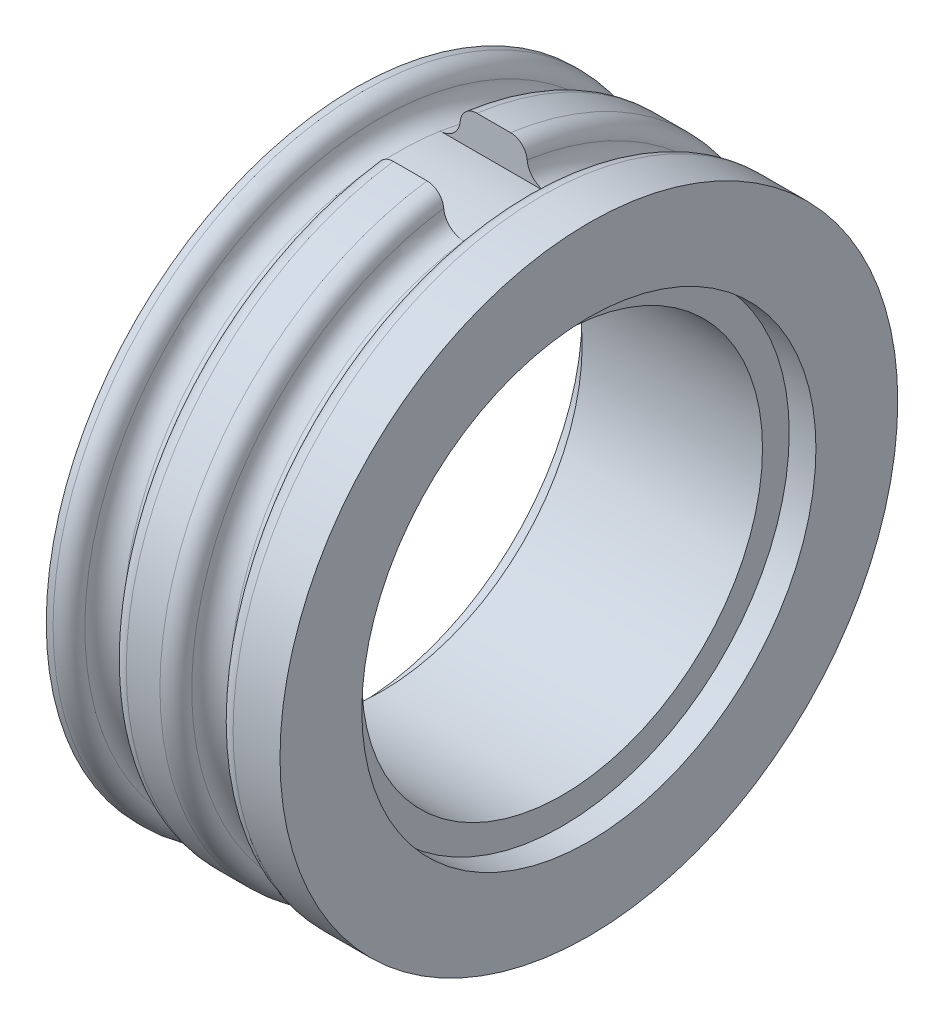
ISO-10303-21;
HEADER;
FILE_DESCRIPTION(('STEP AP214'),'2;1');
FILE_NAME('part.step','',(''),(''),'','','');
FILE_SCHEMA(('AUTOMOTIVE_DESIGN { 1 0 10303 214 1 1 1 1 }'));
ENDSEC;
DATA;
#1=APPLICATION_CONTEXT('core data for automotive mechanical design processes');
#2=APPLICATION_PROTOCOL_DEFINITION('international standard','automotive_design',2000,#1);
#3=PRODUCT_CONTEXT('',#1,'mechanical');
#4=PRODUCT('Part','Part','',(#3));
#5=PRODUCT_RELATED_PRODUCT_CATEGORY('part','',(#4));
#6=PRODUCT_DEFINITION_FORMATION('','',#4);
#7=PRODUCT_DEFINITION_CONTEXT('part definition',#1,'design');
#8=PRODUCT_DEFINITION('design','',#6,#7);
#9=PRODUCT_DEFINITION_SHAPE('','',#8);
#10=(LENGTH_UNIT() NAMED_UNIT(*) SI_UNIT(.MILLI.,.METRE.));
#11=(NAMED_UNIT(*) PLANE_ANGLE_UNIT() SI_UNIT($,.RADIAN.));
#12=(NAMED_UNIT(*) SI_UNIT($,.STERADIAN.) SOLID_ANGLE_UNIT());
#13=UNCERTAINTY_MEASURE_WITH_UNIT(LENGTH_MEASURE(1.E-05),#10,'distance_accuracy_value','');
#14=(GEOMETRIC_REPRESENTATION_CONTEXT(3) GLOBAL_UNCERTAINTY_ASSIGNED_CONTEXT((#13)) GLOBAL_UNIT_ASSIGNED_CONTEXT((#10,
#11,#12)) REPRESENTATION_CONTEXT('',''));
#15=CARTESIAN_POINT('',(0.,0.,0.));
#16=DIRECTION('',(0.,0.,1.));
#17=DIRECTION('',(1.,0.,0.));
#18=AXIS2_PLACEMENT_3D('',#15,#16,#17);
#19=CARTESIAN_POINT('',(7.,0.,0.));
#20=DIRECTION('',(1.,0.,0.));
#21=DIRECTION('',(0.,0.,-1.));
#22=AXIS2_PLACEMENT_3D('',#19,#20,#21);
#23=CYLINDRICAL_SURFACE('',#22,6.);
#24=CARTESIAN_POINT('',(6.2,0.,0.));
#25=DIRECTION('',(1.,0.,0.));
#26=DIRECTION('',(0.,0.,-1.));
#27=AXIS2_PLACEMENT_3D('',#24,#25,#26);
#28=CIRCLE('',#27,6.);
#29=CARTESIAN_POINT('',(6.2,0.,-6.));
#30=VERTEX_POINT('',#29);
#31=EDGE_CURVE('E138',#30,#30,#28,.T.);
#32=ORIENTED_EDGE('',*,*,#31,.T.);
#33=EDGE_LOOP('',(#32));
#34=FACE_BOUND('',#33,.T.);
#35=CARTESIAN_POINT('',(0.8,0.,0.));
#36=DIRECTION('',(-1.,0.,0.));
#37=DIRECTION('',(0.,0.,1.));
#38=AXIS2_PLACEMENT_3D('',#35,#36,#37);
#39=CIRCLE('',#38,6.);
#40=CARTESIAN_POINT('',(0.8,0.,6.));
#41=VERTEX_POINT('',#40);
#42=EDGE_CURVE('E148',#41,#41,#39,.T.);
#43=ORIENTED_EDGE('',*,*,#42,.T.);
#44=EDGE_LOOP('',(#43));
#45=FACE_BOUND('',#44,.T.);
#46=ADVANCED_FACE('F47',(#34,#45),#23,.F.);
#47=CARTESIAN_POINT('',(7.,0.,0.));
#48=DIRECTION('',(-1.,0.,0.));
#49=DIRECTION('',(0.,0.,1.));
#50=AXIS2_PLACEMENT_3D('',#47,#48,#49);
#51=PLANE('',#50);
#52=CARTESIAN_POINT('',(7.,0.,0.));
#53=DIRECTION('',(1.,0.,0.));
#54=DIRECTION('',(0.,0.,-1.));
#55=AXIS2_PLACEMENT_3D('',#52,#53,#54);
#56=CIRCLE('',#55,6.8);
#57=CARTESIAN_POINT('',(7.,0.,-6.8));
#58=VERTEX_POINT('',#57);
#59=EDGE_CURVE('E152',#58,#58,#56,.T.);
#60=ORIENTED_EDGE('',*,*,#59,.F.);
#61=EDGE_LOOP('',(#60));
#62=FACE_BOUND('',#61,.T.);
#63=CARTESIAN_POINT('',(7.,0.,0.));
#64=DIRECTION('',(1.,0.,0.));
#65=DIRECTION('',(0.,0.,-1.));
#66=AXIS2_PLACEMENT_3D('',#63,#64,#65);
#67=CIRCLE('',#66,9.25);
#68=CARTESIAN_POINT('',(7.,0.,-9.25));
#69=VERTEX_POINT('',#68);
#70=EDGE_CURVE('E133',#69,#69,#67,.T.);
#71=ORIENTED_EDGE('',*,*,#70,.T.);
#72=EDGE_LOOP('',(#71));
#73=FACE_BOUND('',#72,.T.);
#74=ADVANCED_FACE('F263',(#62,#73),#51,.F.);
#75=CARTESIAN_POINT('',(7.,0.,0.));
#76=DIRECTION('',(1.,0.,0.));
#77=DIRECTION('',(0.,0.,-1.));
#78=AXIS2_PLACEMENT_3D('',#75,#76,#77);
#79=CYLINDRICAL_SURFACE('',#78,9.25);
#80=CARTESIAN_POINT('',(5.59544511501033,0.,0.));
#81=DIRECTION('',(-1.,0.,0.));
#82=DIRECTION('',(0.,0.,1.));
#83=AXIS2_PLACEMENT_3D('',#80,#81,#82);
#84=CIRCLE('',#83,9.25);
#85=CARTESIAN_POINT('',(5.59544511501033,0.,9.25));
#86=VERTEX_POINT('',#85);
#87=EDGE_CURVE('E154',#86,#86,#84,.F.);
#88=ORIENTED_EDGE('',*,*,#87,.T.);
#89=EDGE_LOOP('',(#88));
#90=FACE_BOUND('',#89,.T.);
#91=ORIENTED_EDGE('',*,*,#70,.F.);
#92=EDGE_LOOP('',(#91));
#93=FACE_BOUND('',#92,.T.);
#94=ADVANCED_FACE('F270',(#90,#93),#79,.T.);
#95=CARTESIAN_POINT('',(7.,0.,0.));
#96=DIRECTION('',(1.,0.,0.));
#97=DIRECTION('',(0.,0.,-1.));
#98=AXIS2_PLACEMENT_3D('',#95,#96,#97);
#99=CYLINDRICAL_SURFACE('',#98,9.25);
#100=DIRECTION('',(1.,0.,0.));
#101=VECTOR('',#100,1.);
#102=CARTESIAN_POINT('',(7.,9.16515138991168,-1.25));
#103=LINE('',#102,#101);
#104=CARTESIAN_POINT('',(2.39544511501033,9.16515138991168,-1.25));
#105=VERTEX_POINT('',#104);
#106=CARTESIAN_POINT('',(3.40455488498967,9.16515138991168,-1.25));
#107=VERTEX_POINT('',#106);
#108=EDGE_CURVE('E126',#105,#107,#103,.T.);
#109=ORIENTED_EDGE('',*,*,#108,.T.);
#110=CARTESIAN_POINT('',(3.40455488498967,0.,0.));
#111=DIRECTION('',(-1.,0.,0.));
#112=DIRECTION('',(0.,0.,1.));
#113=AXIS2_PLACEMENT_3D('',#110,#111,#112);
#114=CIRCLE('',#113,9.25);
#115=CARTESIAN_POINT('',(3.40455488498967,9.16515138991168,1.25));
#116=VERTEX_POINT('',#115);
#117=EDGE_CURVE('E489',#107,#116,#114,.T.);
#118=ORIENTED_EDGE('',*,*,#117,.T.);
#119=DIRECTION('',(1.,0.,0.));
#120=VECTOR('',#119,1.);
#121=CARTESIAN_POINT('',(7.,9.16515138991168,1.25));
#122=LINE('',#121,#120);
#123=CARTESIAN_POINT('',(2.39544511501033,9.16515138991168,1.25));
#124=VERTEX_POINT('',#123);
#125=EDGE_CURVE('E310',#116,#124,#122,.F.);
#126=ORIENTED_EDGE('',*,*,#125,.T.);
#127=CARTESIAN_POINT('',(2.39544511501033,0.,0.));
#128=DIRECTION('',(-1.,0.,0.));
#129=DIRECTION('',(0.,0.,1.));
#130=AXIS2_PLACEMENT_3D('',#127,#128,#129);
#131=CIRCLE('',#130,9.25);
#132=EDGE_CURVE('E491',#124,#105,#131,.F.);
#133=ORIENTED_EDGE('',*,*,#132,.T.);
#134=EDGE_LOOP('',(#109,#118,#126,#133));
#135=FACE_BOUND('',#134,.T.);
#136=ADVANCED_FACE('F284',(#135),#99,.T.);
#137=CARTESIAN_POINT('',(7.,0.,0.));
#138=DIRECTION('',(1.,0.,0.));
#139=DIRECTION('',(0.,0.,-1.));
#140=AXIS2_PLACEMENT_3D('',#137,#138,#139);
#141=CYLINDRICAL_SURFACE('',#140,8.25);
#142=CARTESIAN_POINT('',(4.5,0.,0.));
#143=DIRECTION('',(1.,0.,0.));
#144=DIRECTION('',(0.,0.,-1.));
#145=AXIS2_PLACEMENT_3D('',#142,#143,#144);
#146=CIRCLE('',#145,8.25);
#147=CARTESIAN_POINT('',(4.5,8.15475321515005,1.25));
#148=VERTEX_POINT('',#147);
#149=CARTESIAN_POINT('',(4.5,8.15475321515004,-1.25));
#150=VERTEX_POINT('',#149);
#151=EDGE_CURVE('E124',#148,#150,#146,.F.);
#152=ORIENTED_EDGE('',*,*,#151,.T.);
#153=DIRECTION('',(1.,0.,0.));
#154=VECTOR('',#153,1.);
#155=CARTESIAN_POINT('',(7.,8.15475321515005,-1.25));
#156=LINE('',#155,#154);
#157=CARTESIAN_POINT('',(1.3,8.15475321515004,-1.25));
#158=VERTEX_POINT('',#157);
#159=EDGE_CURVE('E106',#150,#158,#156,.F.);
#160=ORIENTED_EDGE('',*,*,#159,.T.);
#161=CARTESIAN_POINT('',(1.3,0.,0.));
#162=DIRECTION('',(-1.,0.,0.));
#163=DIRECTION('',(0.,0.,1.));
#164=AXIS2_PLACEMENT_3D('',#161,#162,#163);
#165=CIRCLE('',#164,8.25);
#166=CARTESIAN_POINT('',(1.3,8.15475321515004,1.25));
#167=VERTEX_POINT('',#166);
#168=EDGE_CURVE('E121',#158,#167,#165,.F.);
#169=ORIENTED_EDGE('',*,*,#168,.T.);
#170=DIRECTION('',(1.,0.,0.));
#171=VECTOR('',#170,1.);
#172=CARTESIAN_POINT('',(7.,8.15475321515005,1.25));
#173=LINE('',#172,#171);
#174=EDGE_CURVE('E127',#167,#148,#173,.T.);
#175=ORIENTED_EDGE('',*,*,#174,.T.);
#176=EDGE_LOOP('',(#152,#160,#169,#175));
#177=FACE_BOUND('',#176,.T.);
#178=ADVANCED_FACE('F119',(#177),#141,.T.);
#179=CARTESIAN_POINT('',(7.,0.,0.));
#180=DIRECTION('',(1.,0.,0.));
#181=DIRECTION('',(0.,0.,-1.));
#182=AXIS2_PLACEMENT_3D('',#179,#180,#181);
#183=CYLINDRICAL_SURFACE('',#182,9.25);
#184=CARTESIAN_POINT('',(0.204554884989668,0.,0.));
#185=DIRECTION('',(-1.,0.,0.));
#186=DIRECTION('',(0.,0.,1.));
#187=AXIS2_PLACEMENT_3D('',#184,#185,#186);
#188=CIRCLE('',#187,9.25);
#189=CARTESIAN_POINT('',(0.204554884989668,0.,9.25));
#190=VERTEX_POINT('',#189);
#191=EDGE_CURVE('E11',#190,#190,#188,.T.);
#192=ORIENTED_EDGE('',*,*,#191,.T.);
#193=EDGE_LOOP('',(#192));
#194=FACE_BOUND('',#193,.T.);
#195=CARTESIAN_POINT('',(0.,0.,0.));
#196=DIRECTION('',(1.,0.,0.));
#197=DIRECTION('',(0.,0.,-1.));
#198=AXIS2_PLACEMENT_3D('',#195,#196,#197);
#199=CIRCLE('',#198,9.25);
#200=CARTESIAN_POINT('',(0.,0.,-9.25));
#201=VERTEX_POINT('',#200);
#202=EDGE_CURVE('E306',#201,#201,#199,.T.);
#203=ORIENTED_EDGE('',*,*,#202,.T.);
#204=EDGE_LOOP('',(#203));
#205=FACE_BOUND('',#204,.T.);
#206=ADVANCED_FACE('F277',(#194,#205),#183,.T.);
#207=CARTESIAN_POINT('',(0.,0.,0.));
#208=DIRECTION('',(1.,0.,0.));
#209=DIRECTION('',(0.,0.,-1.));
#210=AXIS2_PLACEMENT_3D('',#207,#208,#209);
#211=PLANE('',#210);
#212=CARTESIAN_POINT('',(0.,0.,0.));
#213=DIRECTION('',(-1.,0.,0.));
#214=DIRECTION('',(0.,0.,1.));
#215=AXIS2_PLACEMENT_3D('',#212,#213,#214);
#216=CIRCLE('',#215,6.8);
#217=CARTESIAN_POINT('',(0.,0.,6.8));
#218=VERTEX_POINT('',#217);
#219=EDGE_CURVE('E324',#218,#218,#216,.T.);
#220=ORIENTED_EDGE('',*,*,#219,.F.);
#221=EDGE_LOOP('',(#220));
#222=FACE_BOUND('',#221,.T.);
#223=ORIENTED_EDGE('',*,*,#202,.F.);
#224=EDGE_LOOP('',(#223));
#225=FACE_BOUND('',#224,.T.);
#226=ADVANCED_FACE('F275',(#222,#225),#211,.F.);
#227=CARTESIAN_POINT('',(1.9,-9.251,1.25));
#228=DIRECTION('',(0.,0.,1.));
#229=DIRECTION('',(1.,0.,0.));
#230=AXIS2_PLACEMENT_3D('',#227,#228,#229);
#231=PLANE('',#230);
#232=ORIENTED_EDGE('',*,*,#125,.F.);
#233=CARTESIAN_POINT('',(3.40455488498967,9.16515138991168,1.25));
#234=CARTESIAN_POINT('',(3.43249351819671,9.16517630573256,1.25));
#235=CARTESIAN_POINT('',(3.46042356305605,9.16278954776588,1.25));
#236=CARTESIAN_POINT('',(3.51546379544043,9.15337802234948,1.25));
#237=CARTESIAN_POINT('',(3.54257476786295,9.1463578525907,1.25));
#238=CARTESIAN_POINT('',(3.59524318498539,9.12786045631032,1.25));
#239=CARTESIAN_POINT('',(3.62080000122142,9.11638144041699,1.25));
#240=CARTESIAN_POINT('',(3.66962964992181,9.08931565895298,1.25));
#241=CARTESIAN_POINT('',(3.69290286133862,9.07372957651633,1.25));
#242=CARTESIAN_POINT('',(3.73661188938513,9.03883387161643,1.25));
#243=CARTESIAN_POINT('',(3.75703653731982,9.01951026434254,1.25));
#244=CARTESIAN_POINT('',(3.79439383195117,8.97772648410406,1.25));
#245=CARTESIAN_POINT('',(3.81132504640448,8.95526503098451,1.25));
#246=CARTESIAN_POINT('',(3.84137014952098,8.90763482041923,1.25));
#247=CARTESIAN_POINT('',(3.85444754649019,8.88244309067723,1.25));
#248=CARTESIAN_POINT('',(3.87621626243249,8.83024988408157,1.25));
#249=CARTESIAN_POINT('',(3.88491270801868,8.80325056461052,1.25));
#250=CARTESIAN_POINT('',(3.89397486742518,8.76428718828564,1.25));
#251=CARTESIAN_POINT('',(3.89624114446772,8.75273822521475,1.25));
#252=CARTESIAN_POINT('',(3.89996643720505,8.72953230694176,1.25));
#253=CARTESIAN_POINT('',(3.90142691083805,8.71787558583239,1.25));
#254=CARTESIAN_POINT('',(3.90248448272164,8.70617715539702,1.25));
#255=B_SPLINE_CURVE_WITH_KNOTS('',3,(#233,#234,#235,#236,#237,#238,#239,#240,#241,#242,#243,
#244,#245,#246,#247,#248,#249,#250,#251,#252,#253,#254),.UNSPECIFIED.,.F.,.F.,(4,2,2,2,2,2,2,2,
2,2,4),(0.,0.0837015537140655,0.167320175782605,0.250972389420653,0.334610697844224,
0.418568233726956,0.502560122555834,0.587323500643033,0.671987456402789,0.707272358396004,
0.742493208378861),.UNSPECIFIED.);
#256=CARTESIAN_POINT('',(3.90248448272163,8.70617715539702,1.25));
#257=VERTEX_POINT('',#256);
#258=EDGE_CURVE('E237',#116,#257,#255,.T.);
#259=ORIENTED_EDGE('',*,*,#258,.T.);
#260=CARTESIAN_POINT('',(3.9,8.76127844552381,1.25));
#261=CARTESIAN_POINT('',(3.89997265538567,8.72689711719312,1.25));
#262=CARTESIAN_POINT('',(3.90289465512955,8.6925230484326,1.25));
#263=CARTESIAN_POINT('',(3.91443310590051,8.62476144483251,1.25));
#264=CARTESIAN_POINT('',(3.92304662832296,8.59137341184828,1.25));
#265=CARTESIAN_POINT('',(3.945770528741,8.52650072203028,1.25));
#266=CARTESIAN_POINT('',(3.95988393088263,8.49501712338403,1.25));
#267=CARTESIAN_POINT('',(3.99321189631982,8.43488564864784,1.25));
#268=CARTESIAN_POINT('',(4.01242521430175,8.40623708263192,1.25));
#269=CARTESIAN_POINT('',(4.05534055515531,8.35271610754939,1.25));
#270=CARTESIAN_POINT('',(4.07902408469915,8.32782887577439,1.25));
#271=CARTESIAN_POINT('',(4.13027719101194,8.28242767461534,1.25));
#272=CARTESIAN_POINT('',(4.15784742709977,8.26191444869929,1.25));
#273=CARTESIAN_POINT('',(4.21579258551544,8.22607149517415,1.25));
#274=CARTESIAN_POINT('',(4.24613708076489,8.21069252057722,1.25));
#275=CARTESIAN_POINT('',(4.30898835464157,8.18531802580448,1.25));
#276=CARTESIAN_POINT('',(4.34149349151149,8.17531846946316,1.25));
#277=CARTESIAN_POINT('',(4.3951934722072,8.16370448059767,1.25));
#278=CARTESIAN_POINT('',(4.41602776827407,8.16034978978399,1.25));
#279=CARTESIAN_POINT('',(4.45790488033627,8.15587461564087,1.25));
#280=CARTESIAN_POINT('',(4.47894735753305,8.1547509607681,1.25));
#281=CARTESIAN_POINT('',(4.5,8.15475321515005,1.25));
#282=B_SPLINE_CURVE_WITH_KNOTS('',3,(#260,#261,#262,#263,#264,#265,#266,#267,#268,#269,#270,
#271,#272,#273,#274,#275,#276,#277,#278,#279,#280,#281),.UNSPECIFIED.,.F.,.F.,(4,2,2,2,2,2,2,2,
2,2,4),(0.,0.103010030163312,0.205967097175655,0.308980855888388,0.411969483478009,
0.514541030930208,0.617129999022451,0.718704606329561,0.820202895766365,0.883400942690133,
0.94650908552252),.UNSPECIFIED.);
#283=EDGE_CURVE('E113',#257,#148,#282,.T.);
#284=ORIENTED_EDGE('',*,*,#283,.T.);
#285=ORIENTED_EDGE('',*,*,#174,.F.);
#286=CARTESIAN_POINT('',(1.3,8.15475321515004,1.25));
#287=CARTESIAN_POINT('',(1.3334790648085,8.15472281465346,1.25));
#288=CARTESIAN_POINT('',(1.36694709535971,8.15758618069613,1.25));
#289=CARTESIAN_POINT('',(1.43289493467619,8.16887311438434,1.25));
#290=CARTESIAN_POINT('',(1.46537581423805,8.17729041461115,1.25));
#291=CARTESIAN_POINT('',(1.52847416718042,8.1994628092582,1.25));
#292=CARTESIAN_POINT('',(1.55909096547448,8.21321982433676,1.25));
#293=CARTESIAN_POINT('',(1.61759453037236,8.24564879574432,1.25));
#294=CARTESIAN_POINT('',(1.64548150932836,8.26432036935317,1.25));
#295=CARTESIAN_POINT('',(1.69790430522425,8.30614500443749,1.25));
#296=CARTESIAN_POINT('',(1.72242168700626,8.32932116482762,1.25));
#297=CARTESIAN_POINT('',(1.76727272338382,8.3794261165137,1.25));
#298=CARTESIAN_POINT('',(1.78760546047212,8.40635572860911,1.25));
#299=CARTESIAN_POINT('',(1.82373908414544,8.46351221676507,1.25));
#300=CARTESIAN_POINT('',(1.83948794902048,8.49377194717674,1.25));
#301=CARTESIAN_POINT('',(1.86572832173276,8.55648437252788,1.25));
#302=CARTESIAN_POINT('',(1.87622218641266,8.5889360769527,1.25));
#303=CARTESIAN_POINT('',(1.88928322010643,8.64483691982866,1.25));
#304=CARTESIAN_POINT('',(1.89329918455923,8.66795840004871,1.25));
#305=CARTESIAN_POINT('',(1.89865743721294,8.71447640795544,1.25));
#306=CARTESIAN_POINT('',(1.90000343985473,8.73787250791508,1.25));
#307=CARTESIAN_POINT('',(1.9,8.7612784455238,1.25));
#308=B_SPLINE_CURVE_WITH_KNOTS('',3,(#286,#287,#288,#289,#290,#291,#292,#293,#294,#295,#296,
#297,#298,#299,#300,#301,#302,#303,#304,#305,#306,#307),.UNSPECIFIED.,.F.,.F.,(4,2,2,2,2,2,2,2,
2,2,4),(0.,0.100298690035411,0.200484389668559,0.300706158846184,0.400920125583871,
0.501662220799839,0.602426380819123,0.704293098567151,0.806114088565952,0.876371992339193,
0.946532084836466),.UNSPECIFIED.);
#309=CARTESIAN_POINT('',(1.89751551727836,8.70617715539703,1.25));
#310=VERTEX_POINT('',#309);
#311=EDGE_CURVE('E112',#167,#310,#308,.T.);
#312=ORIENTED_EDGE('',*,*,#311,.T.);
#313=CARTESIAN_POINT('',(1.89751551727836,8.70617715539703,1.25));
#314=CARTESIAN_POINT('',(1.90006304574641,8.73462779393716,1.25));
#315=CARTESIAN_POINT('',(1.90504454310268,8.76285413245912,1.25));
#316=CARTESIAN_POINT('',(1.91964326050335,8.81807053757934,1.25));
#317=CARTESIAN_POINT('',(1.92925871051169,8.84506107191219,1.25));
#318=CARTESIAN_POINT('',(1.95290303812401,8.89705786740657,1.25));
#319=CARTESIAN_POINT('',(1.96693475902044,8.92206283719328,1.25));
#320=CARTESIAN_POINT('',(1.99901491320592,8.96933608439755,1.25));
#321=CARTESIAN_POINT('',(2.01706193468096,8.99160531946155,1.25));
#322=CARTESIAN_POINT('',(2.05655695452913,9.03263699815714,1.25));
#323=CARTESIAN_POINT('',(2.07798425774765,9.05141935772002,1.25));
#324=CARTESIAN_POINT('',(2.12372436067358,9.08508767374263,1.25));
#325=CARTESIAN_POINT('',(2.14803829244762,9.09997209413905,1.25));
#326=CARTESIAN_POINT('',(2.19861460166322,9.12527068061503,1.25));
#327=CARTESIAN_POINT('',(2.2248577509179,9.13572338427393,1.25));
#328=CARTESIAN_POINT('',(2.27871505217389,9.15202356795346,1.25));
#329=CARTESIAN_POINT('',(2.30632712817068,9.15787780745276,1.25));
#330=CARTESIAN_POINT('',(2.34436688511686,9.16261839523726,1.25));
#331=CARTESIAN_POINT('',(2.35456853815727,9.16356866772534,1.25));
#332=CARTESIAN_POINT('',(2.37499367365264,9.16483435027612,1.25));
#333=CARTESIAN_POINT('',(2.38521708904999,9.1651508420461,1.25));
#334=CARTESIAN_POINT('',(2.39544511501033,9.16515138991168,1.25));
#335=B_SPLINE_CURVE_WITH_KNOTS('',3,(#313,#314,#315,#316,#317,#318,#319,#320,#321,#322,#323,
#324,#325,#326,#327,#328,#329,#330,#331,#332,#333,#334),.UNSPECIFIED.,.F.,.F.,(4,2,2,2,2,2,2,2,
2,2,4),(0.,0.0855850579152972,0.171137450690269,0.256745037042217,0.34232257046966,
0.42739516864722,0.512501241160406,0.596851259662101,0.681077055225586,0.711799510917866,
0.742469486116249),.UNSPECIFIED.);
#336=EDGE_CURVE('E70',#310,#124,#335,.T.);
#337=ORIENTED_EDGE('',*,*,#336,.T.);
#338=EDGE_LOOP('',(#232,#259,#284,#285,#312,#337));
#339=FACE_BOUND('',#338,.T.);
#340=ADVANCED_FACE('F187',(#339),#231,.F.);
#341=CARTESIAN_POINT('',(1.9,-9.251,-1.25));
#342=DIRECTION('',(0.,0.,-1.));
#343=DIRECTION('',(-1.,0.,0.));
#344=AXIS2_PLACEMENT_3D('',#341,#342,#343);
#345=PLANE('',#344);
#346=CARTESIAN_POINT('',(4.5,8.15475321515004,-1.25));
#347=CARTESIAN_POINT('',(4.4665209351915,8.15472281465346,-1.25));
#348=CARTESIAN_POINT('',(4.43305290464029,8.15758618069613,-1.25));
#349=CARTESIAN_POINT('',(4.36710506532381,8.16887311438434,-1.25));
#350=CARTESIAN_POINT('',(4.33462418576195,8.17729041461115,-1.25));
#351=CARTESIAN_POINT('',(4.27152583281958,8.1994628092582,-1.25));
#352=CARTESIAN_POINT('',(4.24090903452552,8.21321982433676,-1.25));
#353=CARTESIAN_POINT('',(4.18240546962764,8.24564879574432,-1.25));
#354=CARTESIAN_POINT('',(4.15451849067164,8.26432036935317,-1.25));
#355=CARTESIAN_POINT('',(4.10209569477575,8.30614500443749,-1.25));
#356=CARTESIAN_POINT('',(4.07757831299374,8.32932116482762,-1.25));
#357=CARTESIAN_POINT('',(4.03272727661618,8.3794261165137,-1.25));
#358=CARTESIAN_POINT('',(4.01239453952788,8.40635572860911,-1.25));
#359=CARTESIAN_POINT('',(3.97626091585456,8.46351221676507,-1.25));
#360=CARTESIAN_POINT('',(3.96051205097952,8.49377194717674,-1.25));
#361=CARTESIAN_POINT('',(3.93427167826724,8.55648437252788,-1.25));
#362=CARTESIAN_POINT('',(3.92377781358734,8.5889360769527,-1.25));
#363=CARTESIAN_POINT('',(3.91071677989357,8.64483691982866,-1.25));
#364=CARTESIAN_POINT('',(3.90670081544077,8.66795840004871,-1.25));
#365=CARTESIAN_POINT('',(3.90134256278706,8.71447640795544,-1.25));
#366=CARTESIAN_POINT('',(3.89999656014527,8.73787250791508,-1.25));
#367=CARTESIAN_POINT('',(3.9,8.76127844552381,-1.25));
#368=B_SPLINE_CURVE_WITH_KNOTS('',3,(#346,#347,#348,#349,#350,#351,#352,#353,#354,#355,#356,
#357,#358,#359,#360,#361,#362,#363,#364,#365,#366,#367),.UNSPECIFIED.,.F.,.F.,(4,2,2,2,2,2,2,2,
2,2,4),(0.,0.10029869003541,0.200484389668559,0.300706158846186,0.400920125583872,
0.501662220799839,0.602426380819121,0.704293098567153,0.806114088565952,0.876371992339194,
0.946532084836467),.UNSPECIFIED.);
#369=CARTESIAN_POINT('',(3.90248448272164,8.70617715539703,-1.25));
#370=VERTEX_POINT('',#369);
#371=EDGE_CURVE('E195',#150,#370,#368,.T.);
#372=ORIENTED_EDGE('',*,*,#371,.T.);
#373=CARTESIAN_POINT('',(3.90248448272164,8.70617715539703,-1.25));
#374=CARTESIAN_POINT('',(3.8999369542536,8.73462779393716,-1.25));
#375=CARTESIAN_POINT('',(3.89495545689732,8.76285413245912,-1.25));
#376=CARTESIAN_POINT('',(3.88035673949665,8.81807053757934,-1.25));
#377=CARTESIAN_POINT('',(3.87074128948832,8.84506107191219,-1.25));
#378=CARTESIAN_POINT('',(3.84709696187599,8.89705786740657,-1.25));
#379=CARTESIAN_POINT('',(3.83306524097956,8.92206283719329,-1.25));
#380=CARTESIAN_POINT('',(3.80098508679407,8.96933608439755,-1.25));
#381=CARTESIAN_POINT('',(3.78293806531904,8.99160531946156,-1.25));
#382=CARTESIAN_POINT('',(3.74344304547087,9.03263699815714,-1.25));
#383=CARTESIAN_POINT('',(3.72201574225235,9.05141935772002,-1.25));
#384=CARTESIAN_POINT('',(3.67627563932642,9.08508767374263,-1.25));
#385=CARTESIAN_POINT('',(3.65196170755238,9.09997209413905,-1.25));
#386=CARTESIAN_POINT('',(3.60138539833679,9.12527068061503,-1.25));
#387=CARTESIAN_POINT('',(3.5751422490821,9.13572338427393,-1.25));
#388=CARTESIAN_POINT('',(3.52128494782612,9.15202356795346,-1.25));
#389=CARTESIAN_POINT('',(3.49367287182932,9.15787780745276,-1.25));
#390=CARTESIAN_POINT('',(3.45563311488314,9.16261839523726,-1.25));
#391=CARTESIAN_POINT('',(3.44543146184273,9.16356866772534,-1.25));
#392=CARTESIAN_POINT('',(3.42500632634736,9.16483435027612,-1.25));
#393=CARTESIAN_POINT('',(3.41478291095001,9.1651508420461,-1.25));
#394=CARTESIAN_POINT('',(3.40455488498967,9.16515138991168,-1.25));
#395=B_SPLINE_CURVE_WITH_KNOTS('',3,(#373,#374,#375,#376,#377,#378,#379,#380,#381,#382,#383,
#384,#385,#386,#387,#388,#389,#390,#391,#392,#393,#394),.UNSPECIFIED.,.F.,.F.,(4,2,2,2,2,2,2,2,
2,2,4),(0.,0.0855850579152972,0.171137450690269,0.256745037042221,0.34232257046966,
0.42739516864722,0.512501241160406,0.596851259662101,0.681077055225585,0.711799510917866,
0.742469486116249),.UNSPECIFIED.);
#396=EDGE_CURVE('E173',#370,#107,#395,.T.);
#397=ORIENTED_EDGE('',*,*,#396,.T.);
#398=ORIENTED_EDGE('',*,*,#108,.F.);
#399=CARTESIAN_POINT('',(2.39544511501033,9.16515138991168,-1.25));
#400=CARTESIAN_POINT('',(2.36750648180329,9.16517630573256,-1.25));
#401=CARTESIAN_POINT('',(2.33957643694395,9.16278954776588,-1.25));
#402=CARTESIAN_POINT('',(2.28453620455957,9.15337802234948,-1.25));
#403=CARTESIAN_POINT('',(2.25742523213705,9.1463578525907,-1.25));
#404=CARTESIAN_POINT('',(2.20475681501461,9.12786045631032,-1.25));
#405=CARTESIAN_POINT('',(2.17919999877858,9.11638144041699,-1.25));
#406=CARTESIAN_POINT('',(2.13037035007819,9.08931565895298,-1.25));
#407=CARTESIAN_POINT('',(2.10709713866138,9.07372957651633,-1.25));
#408=CARTESIAN_POINT('',(2.06338811061487,9.03883387161643,-1.25));
#409=CARTESIAN_POINT('',(2.04296346268018,9.01951026434254,-1.25));
#410=CARTESIAN_POINT('',(2.00560616804883,8.97772648410406,-1.25));
#411=CARTESIAN_POINT('',(1.98867495359552,8.95526503098451,-1.25));
#412=CARTESIAN_POINT('',(1.95862985047902,8.90763482041923,-1.25));
#413=CARTESIAN_POINT('',(1.94555245350981,8.88244309067723,-1.25));
#414=CARTESIAN_POINT('',(1.92378373756751,8.83024988408157,-1.25));
#415=CARTESIAN_POINT('',(1.91508729198132,8.80325056461052,-1.25));
#416=CARTESIAN_POINT('',(1.90602513257482,8.76428718828564,-1.25));
#417=CARTESIAN_POINT('',(1.90375885553228,8.75273822521475,-1.25));
#418=CARTESIAN_POINT('',(1.90003356279495,8.72953230694176,-1.25));
#419=CARTESIAN_POINT('',(1.89857308916195,8.71787558583239,-1.25));
#420=CARTESIAN_POINT('',(1.89751551727836,8.70617715539702,-1.25));
#421=B_SPLINE_CURVE_WITH_KNOTS('',3,(#399,#400,#401,#402,#403,#404,#405,#406,#407,#408,#409,
#410,#411,#412,#413,#414,#415,#416,#417,#418,#419,#420),.UNSPECIFIED.,.F.,.F.,(4,2,2,2,2,2,2,2,
2,2,4),(0.,0.0837015537140655,0.167320175782605,0.250972389420653,0.334610697844224,
0.418568233726956,0.502560122555834,0.587323500643033,0.671987456402789,0.707272358396004,
0.742493208378861),.UNSPECIFIED.);
#422=CARTESIAN_POINT('',(1.89751551727837,8.70617715539702,-1.25));
#423=VERTEX_POINT('',#422);
#424=EDGE_CURVE('E109',#105,#423,#421,.T.);
#425=ORIENTED_EDGE('',*,*,#424,.T.);
#426=CARTESIAN_POINT('',(1.9,8.7612784455238,-1.25));
#427=CARTESIAN_POINT('',(1.90002734461433,8.72689711719311,-1.25));
#428=CARTESIAN_POINT('',(1.89710534487045,8.6925230484326,-1.25));
#429=CARTESIAN_POINT('',(1.88556689409949,8.6247614448325,-1.25));
#430=CARTESIAN_POINT('',(1.87695337167704,8.59137341184828,-1.25));
#431=CARTESIAN_POINT('',(1.854229471259,8.52650072203028,-1.25));
#432=CARTESIAN_POINT('',(1.84011606911737,8.49501712338403,-1.25));
#433=CARTESIAN_POINT('',(1.80678810368018,8.43488564864784,-1.25));
#434=CARTESIAN_POINT('',(1.78757478569825,8.40623708263192,-1.25));
#435=CARTESIAN_POINT('',(1.74465944484469,8.35271610754938,-1.25));
#436=CARTESIAN_POINT('',(1.72097591530085,8.32782887577439,-1.25));
#437=CARTESIAN_POINT('',(1.66972280898806,8.28242767461534,-1.25));
#438=CARTESIAN_POINT('',(1.64215257290023,8.26191444869928,-1.25));
#439=CARTESIAN_POINT('',(1.58420741448455,8.22607149517415,-1.25));
#440=CARTESIAN_POINT('',(1.55386291923511,8.21069252057722,-1.25));
#441=CARTESIAN_POINT('',(1.49101164535843,8.18531802580448,-1.25));
#442=CARTESIAN_POINT('',(1.45850650848851,8.17531846946316,-1.25));
#443=CARTESIAN_POINT('',(1.4048065277928,8.16370448059767,-1.25));
#444=CARTESIAN_POINT('',(1.38397223172593,8.16034978978399,-1.25));
#445=CARTESIAN_POINT('',(1.34209511966373,8.15587461564087,-1.25));
#446=CARTESIAN_POINT('',(1.32105264246695,8.1547509607681,-1.25));
#447=CARTESIAN_POINT('',(1.3,8.15475321515005,-1.25));
#448=B_SPLINE_CURVE_WITH_KNOTS('',3,(#426,#427,#428,#429,#430,#431,#432,#433,#434,#435,#436,
#437,#438,#439,#440,#441,#442,#443,#444,#445,#446,#447),.UNSPECIFIED.,.F.,.F.,(4,2,2,2,2,2,2,2,
2,2,4),(0.,0.103010030163313,0.205967097175655,0.308980855888387,0.41196948347801,
0.51454103093021,0.617129999022452,0.718704606329564,0.820202895766366,0.883400942690132,
0.946509085522518),.UNSPECIFIED.);
#449=EDGE_CURVE('E102',#423,#158,#448,.T.);
#450=ORIENTED_EDGE('',*,*,#449,.T.);
#451=ORIENTED_EDGE('',*,*,#159,.F.);
#452=EDGE_LOOP('',(#372,#397,#398,#425,#450,#451));
#453=FACE_BOUND('',#452,.T.);
#454=ADVANCED_FACE('F105',(#453),#345,.F.);
#455=CARTESIAN_POINT('',(4.5,0.,0.));
#456=DIRECTION('',(-1.,0.,0.));
#457=DIRECTION('',(0.,0.,1.));
#458=AXIS2_PLACEMENT_3D('',#455,#456,#457);
#459=TOROIDAL_SURFACE('',#458,8.85,0.6);
#460=ORIENTED_EDGE('',*,*,#283,.F.);
#461=CARTESIAN_POINT('',(3.90248448272189,0.,0.));
#462=DIRECTION('',(1.,0.,0.));
#463=DIRECTION('',(0.,0.,-1.));
#464=AXIS2_PLACEMENT_3D('',#461,#462,#463);
#465=CIRCLE('',#464,8.79545454545457);
#466=EDGE_CURVE('E162',#257,#370,#465,.T.);
#467=ORIENTED_EDGE('',*,*,#466,.T.);
#468=ORIENTED_EDGE('',*,*,#371,.F.);
#469=CARTESIAN_POINT('',(4.5,0.,0.));
#470=DIRECTION('',(-1.,0.,0.));
#471=DIRECTION('',(0.,0.,1.));
#472=AXIS2_PLACEMENT_3D('',#469,#470,#471);
#473=CIRCLE('',#472,8.25);
#474=EDGE_CURVE('E137',#148,#150,#473,.F.);
#475=ORIENTED_EDGE('',*,*,#474,.F.);
#476=EDGE_LOOP('',(#460,#467,#468,#475));
#477=FACE_BOUND('',#476,.T.);
#478=ADVANCED_FACE('F186',(#477),#459,.F.);
#479=CARTESIAN_POINT('',(4.5,0.,0.));
#480=DIRECTION('',(1.,0.,0.));
#481=DIRECTION('',(0.,0.,-1.));
#482=AXIS2_PLACEMENT_3D('',#479,#480,#481);
#483=TOROIDAL_SURFACE('',#482,8.85,0.6);
#484=CARTESIAN_POINT('',(5.0975155172808,0.,0.));
#485=DIRECTION('',(-1.,0.,0.));
#486=DIRECTION('',(0.,0.,1.));
#487=AXIS2_PLACEMENT_3D('',#484,#485,#486);
#488=CIRCLE('',#487,8.79545454545432);
#489=CARTESIAN_POINT('',(5.0975155172808,0.,8.79545454545432));
#490=VERTEX_POINT('',#489);
#491=EDGE_CURVE('E158',#490,#490,#488,.T.);
#492=ORIENTED_EDGE('',*,*,#491,.T.);
#493=EDGE_LOOP('',(#492));
#494=FACE_BOUND('',#493,.T.);
#495=ORIENTED_EDGE('',*,*,#151,.F.);
#496=ORIENTED_EDGE('',*,*,#474,.T.);
#497=EDGE_LOOP('',(#495,#496));
#498=FACE_BOUND('',#497,.T.);
#499=ADVANCED_FACE('F225',(#494,#498),#483,.F.);
#500=CARTESIAN_POINT('',(1.3,0.,0.));
#501=DIRECTION('',(-1.,0.,0.));
#502=DIRECTION('',(0.,0.,1.));
#503=AXIS2_PLACEMENT_3D('',#500,#501,#502);
#504=TOROIDAL_SURFACE('',#503,8.85,0.6);
#505=CARTESIAN_POINT('',(0.702484482720536,0.,0.));
#506=DIRECTION('',(1.,0.,0.));
#507=DIRECTION('',(0.,0.,-1.));
#508=AXIS2_PLACEMENT_3D('',#505,#506,#507);
#509=CIRCLE('',#508,8.79545454545445);
#510=CARTESIAN_POINT('',(0.702484482720536,0.,-8.79545454545445));
#511=VERTEX_POINT('',#510);
#512=EDGE_CURVE('E56',#511,#511,#509,.T.);
#513=ORIENTED_EDGE('',*,*,#512,.T.);
#514=EDGE_LOOP('',(#513));
#515=FACE_BOUND('',#514,.T.);
#516=CARTESIAN_POINT('',(1.3,0.,0.));
#517=DIRECTION('',(-1.,0.,0.));
#518=DIRECTION('',(0.,0.,1.));
#519=AXIS2_PLACEMENT_3D('',#516,#517,#518);
#520=CIRCLE('',#519,8.25);
#521=EDGE_CURVE('E131',#167,#158,#520,.F.);
#522=ORIENTED_EDGE('',*,*,#521,.F.);
#523=ORIENTED_EDGE('',*,*,#168,.F.);
#524=EDGE_LOOP('',(#522,#523));
#525=FACE_BOUND('',#524,.T.);
#526=ADVANCED_FACE('F130',(#515,#525),#504,.F.);
#527=CARTESIAN_POINT('',(1.3,0.,0.));
#528=DIRECTION('',(1.,0.,0.));
#529=DIRECTION('',(0.,0.,-1.));
#530=AXIS2_PLACEMENT_3D('',#527,#528,#529);
#531=TOROIDAL_SURFACE('',#530,8.85,0.6);
#532=ORIENTED_EDGE('',*,*,#449,.F.);
#533=CARTESIAN_POINT('',(1.89751551727811,0.,0.));
#534=DIRECTION('',(-1.,0.,0.));
#535=DIRECTION('',(0.,0.,1.));
#536=AXIS2_PLACEMENT_3D('',#533,#534,#535);
#537=CIRCLE('',#536,8.79545454545457);
#538=EDGE_CURVE('E63',#423,#310,#537,.T.);
#539=ORIENTED_EDGE('',*,*,#538,.T.);
#540=ORIENTED_EDGE('',*,*,#311,.F.);
#541=ORIENTED_EDGE('',*,*,#521,.T.);
#542=EDGE_LOOP('',(#532,#539,#540,#541));
#543=FACE_BOUND('',#542,.T.);
#544=ADVANCED_FACE('F135',(#543),#531,.F.);
#545=CARTESIAN_POINT('',(6.2,0.,0.));
#546=DIRECTION('',(1.,0.,0.));
#547=DIRECTION('',(0.,0.,-1.));
#548=AXIS2_PLACEMENT_3D('',#545,#546,#547);
#549=CYLINDRICAL_SURFACE('',#548,6.8);
#550=CARTESIAN_POINT('',(6.2,0.,0.));
#551=DIRECTION('',(1.,0.,0.));
#552=DIRECTION('',(0.,0.,-1.));
#553=AXIS2_PLACEMENT_3D('',#550,#551,#552);
#554=CIRCLE('',#553,6.8);
#555=CARTESIAN_POINT('',(6.2,0.,-6.8));
#556=VERTEX_POINT('',#555);
#557=EDGE_CURVE('E144',#556,#556,#554,.T.);
#558=ORIENTED_EDGE('',*,*,#557,.F.);
#559=EDGE_LOOP('',(#558));
#560=FACE_BOUND('',#559,.T.);
#561=ORIENTED_EDGE('',*,*,#59,.T.);
#562=EDGE_LOOP('',(#561));
#563=FACE_BOUND('',#562,.T.);
#564=ADVANCED_FACE('F188',(#560,#563),#549,.F.);
#565=CARTESIAN_POINT('',(6.2,0.,0.));
#566=DIRECTION('',(1.,0.,0.));
#567=DIRECTION('',(0.,0.,-1.));
#568=AXIS2_PLACEMENT_3D('',#565,#566,#567);
#569=PLANE('',#568);
#570=ORIENTED_EDGE('',*,*,#31,.F.);
#571=EDGE_LOOP('',(#570));
#572=FACE_BOUND('',#571,.T.);
#573=ORIENTED_EDGE('',*,*,#557,.T.);
#574=EDGE_LOOP('',(#573));
#575=FACE_BOUND('',#574,.T.);
#576=ADVANCED_FACE('F336',(#572,#575),#569,.T.);
#577=CARTESIAN_POINT('',(0.8,0.,0.));
#578=DIRECTION('',(-1.,0.,0.));
#579=DIRECTION('',(0.,0.,1.));
#580=AXIS2_PLACEMENT_3D('',#577,#578,#579);
#581=CYLINDRICAL_SURFACE('',#580,6.8);
#582=CARTESIAN_POINT('',(0.8,0.,0.));
#583=DIRECTION('',(-1.,0.,0.));
#584=DIRECTION('',(0.,0.,1.));
#585=AXIS2_PLACEMENT_3D('',#582,#583,#584);
#586=CIRCLE('',#585,6.8);
#587=CARTESIAN_POINT('',(0.8,0.,6.8));
#588=VERTEX_POINT('',#587);
#589=EDGE_CURVE('E153',#588,#588,#586,.T.);
#590=ORIENTED_EDGE('',*,*,#589,.F.);
#591=EDGE_LOOP('',(#590));
#592=FACE_BOUND('',#591,.T.);
#593=ORIENTED_EDGE('',*,*,#219,.T.);
#594=EDGE_LOOP('',(#593));
#595=FACE_BOUND('',#594,.T.);
#596=ADVANCED_FACE('F333',(#592,#595),#581,.F.);
#597=CARTESIAN_POINT('',(0.8,0.,0.));
#598=DIRECTION('',(-1.,0.,0.));
#599=DIRECTION('',(0.,0.,1.));
#600=AXIS2_PLACEMENT_3D('',#597,#598,#599);
#601=PLANE('',#600);
#602=ORIENTED_EDGE('',*,*,#42,.F.);
#603=EDGE_LOOP('',(#602));
#604=FACE_BOUND('',#603,.T.);
#605=ORIENTED_EDGE('',*,*,#589,.T.);
#606=EDGE_LOOP('',(#605));
#607=FACE_BOUND('',#606,.T.);
#608=ADVANCED_FACE('F230',(#604,#607),#601,.T.);
#609=CARTESIAN_POINT('',(5.59544511501033,0.,0.));
#610=DIRECTION('',(-1.,0.,0.));
#611=DIRECTION('',(0.,0.,1.));
#612=AXIS2_PLACEMENT_3D('',#609,#610,#611);
#613=TOROIDAL_SURFACE('',#612,8.75,0.5);
#614=ORIENTED_EDGE('',*,*,#491,.F.);
#615=EDGE_LOOP('',(#614));
#616=FACE_BOUND('',#615,.T.);
#617=ORIENTED_EDGE('',*,*,#87,.F.);
#618=EDGE_LOOP('',(#617));
#619=FACE_BOUND('',#618,.T.);
#620=ADVANCED_FACE('F227',(#616,#619),#613,.T.);
#621=CARTESIAN_POINT('',(3.40455488498967,0.,0.));
#622=DIRECTION('',(-1.,0.,0.));
#623=DIRECTION('',(0.,0.,1.));
#624=AXIS2_PLACEMENT_3D('',#621,#622,#623);
#625=TOROIDAL_SURFACE('',#624,8.75,0.5);
#626=ORIENTED_EDGE('',*,*,#258,.F.);
#627=ORIENTED_EDGE('',*,*,#117,.F.);
#628=ORIENTED_EDGE('',*,*,#396,.F.);
#629=ORIENTED_EDGE('',*,*,#466,.F.);
#630=EDGE_LOOP('',(#626,#627,#628,#629));
#631=FACE_BOUND('',#630,.T.);
#632=ADVANCED_FACE('F229',(#631),#625,.T.);
#633=CARTESIAN_POINT('',(2.39544511501033,0.,0.));
#634=DIRECTION('',(-1.,0.,0.));
#635=DIRECTION('',(0.,0.,1.));
#636=AXIS2_PLACEMENT_3D('',#633,#634,#635);
#637=TOROIDAL_SURFACE('',#636,8.75,0.5);
#638=ORIENTED_EDGE('',*,*,#336,.F.);
#639=ORIENTED_EDGE('',*,*,#538,.F.);
#640=ORIENTED_EDGE('',*,*,#424,.F.);
#641=ORIENTED_EDGE('',*,*,#132,.F.);
#642=EDGE_LOOP('',(#638,#639,#640,#641));
#643=FACE_BOUND('',#642,.T.);
#644=ADVANCED_FACE('F180',(#643),#637,.T.);
#645=CARTESIAN_POINT('',(0.204554884989668,0.,0.));
#646=DIRECTION('',(-1.,0.,0.));
#647=DIRECTION('',(0.,0.,1.));
#648=AXIS2_PLACEMENT_3D('',#645,#646,#647);
#649=TOROIDAL_SURFACE('',#648,8.75,0.5);
#650=ORIENTED_EDGE('',*,*,#191,.F.);
#651=EDGE_LOOP('',(#650));
#652=FACE_BOUND('',#651,.T.);
#653=ORIENTED_EDGE('',*,*,#512,.F.);
#654=EDGE_LOOP('',(#653));
#655=FACE_BOUND('',#654,.T.);
#656=ADVANCED_FACE('F49',(#652,#655),#649,.T.);
#657=CLOSED_SHELL('',(#46,#74,#94,#136,#178,#206,#226,#340,#454,#478,#499,#526,#544,#564,#576,
#596,#608,#620,#632,#644,#656));
#658=MANIFOLD_SOLID_BREP('B2',#657);
#659=ADVANCED_BREP_SHAPE_REPRESENTATION('',(#18,#658),#14);
#660=SHAPE_DEFINITION_REPRESENTATION(#9,#659);
ENDSEC;
END-ISO-10303-21;
